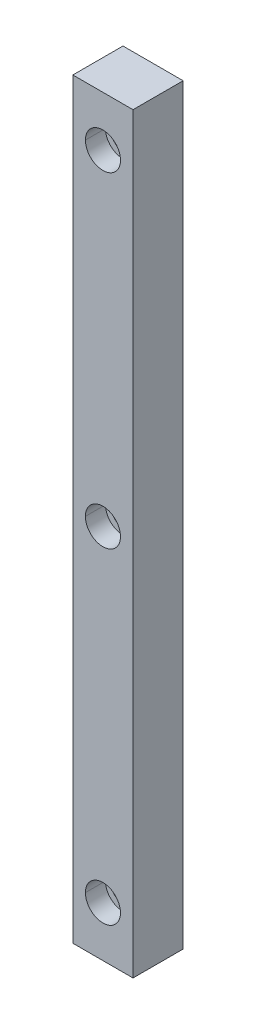
ISO-10303-21;
HEADER;
FILE_DESCRIPTION(('STEP AP214'),'2;1');
FILE_NAME('part.step','',(''),(''),'','','');
FILE_SCHEMA(('AUTOMOTIVE_DESIGN { 1 0 10303 214 1 1 1 1 }'));
ENDSEC;
DATA;
#1=APPLICATION_CONTEXT('core data for automotive mechanical design processes');
#2=APPLICATION_PROTOCOL_DEFINITION('international standard','automotive_design',2000,#1);
#3=PRODUCT_CONTEXT('',#1,'mechanical');
#4=PRODUCT('Part','Part','',(#3));
#5=PRODUCT_RELATED_PRODUCT_CATEGORY('part','',(#4));
#6=PRODUCT_DEFINITION_FORMATION('','',#4);
#7=PRODUCT_DEFINITION_CONTEXT('part definition',#1,'design');
#8=PRODUCT_DEFINITION('design','',#6,#7);
#9=PRODUCT_DEFINITION_SHAPE('','',#8);
#10=(LENGTH_UNIT() NAMED_UNIT(*) SI_UNIT(.MILLI.,.METRE.));
#11=(NAMED_UNIT(*) PLANE_ANGLE_UNIT() SI_UNIT($,.RADIAN.));
#12=(NAMED_UNIT(*) SI_UNIT($,.STERADIAN.) SOLID_ANGLE_UNIT());
#13=UNCERTAINTY_MEASURE_WITH_UNIT(LENGTH_MEASURE(1.E-05),#10,'distance_accuracy_value','');
#14=(GEOMETRIC_REPRESENTATION_CONTEXT(3) GLOBAL_UNCERTAINTY_ASSIGNED_CONTEXT((#13)) GLOBAL_UNIT_ASSIGNED_CONTEXT((#10,
#11,#12)) REPRESENTATION_CONTEXT('',''));
#15=CARTESIAN_POINT('',(0.,0.,0.));
#16=DIRECTION('',(0.,0.,1.));
#17=DIRECTION('',(1.,0.,0.));
#18=AXIS2_PLACEMENT_3D('',#15,#16,#17);
#19=CARTESIAN_POINT('',(0.,-65.,6.));
#20=DIRECTION('',(0.,0.,1.));
#21=DIRECTION('',(1.,0.,0.));
#22=AXIS2_PLACEMENT_3D('',#19,#20,#21);
#23=CYLINDRICAL_SURFACE('',#22,3.5);
#24=CARTESIAN_POINT('',(0.,-65.,6.));
#25=DIRECTION('',(0.,0.,1.));
#26=DIRECTION('',(1.,0.,0.));
#27=AXIS2_PLACEMENT_3D('',#24,#25,#26);
#28=CIRCLE('',#27,3.5);
#29=CARTESIAN_POINT('',(-3.5,-65.,6.));
#30=VERTEX_POINT('',#29);
#31=CARTESIAN_POINT('',(3.5,-65.,6.));
#32=VERTEX_POINT('',#31);
#33=EDGE_CURVE('E41',#30,#32,#28,.T.);
#34=ORIENTED_EDGE('',*,*,#33,.F.);
#35=DIRECTION('',(0.,0.,1.));
#36=VECTOR('',#35,1.);
#37=CARTESIAN_POINT('',(-3.5,-65.,6.));
#38=LINE('',#37,#36);
#39=CARTESIAN_POINT('',(-3.5,-65.,10.));
#40=VERTEX_POINT('',#39);
#41=EDGE_CURVE('E11',#30,#40,#38,.T.);
#42=ORIENTED_EDGE('',*,*,#41,.T.);
#43=CARTESIAN_POINT('',(0.,-65.,10.));
#44=DIRECTION('',(0.,0.,1.));
#45=DIRECTION('',(1.,0.,0.));
#46=AXIS2_PLACEMENT_3D('',#43,#44,#45);
#47=CIRCLE('',#46,3.5);
#48=CARTESIAN_POINT('',(3.5,-65.,10.));
#49=VERTEX_POINT('',#48);
#50=EDGE_CURVE('E27',#40,#49,#47,.T.);
#51=ORIENTED_EDGE('',*,*,#50,.T.);
#52=DIRECTION('',(0.,0.,1.));
#53=VECTOR('',#52,1.);
#54=CARTESIAN_POINT('',(3.5,-65.,6.));
#55=LINE('',#54,#53);
#56=EDGE_CURVE('E253',#32,#49,#55,.T.);
#57=ORIENTED_EDGE('',*,*,#56,.F.);
#58=EDGE_LOOP('',(#34,#42,#51,#57));
#59=FACE_BOUND('',#58,.T.);
#60=ADVANCED_FACE('F16',(#59),#23,.F.);
#61=CARTESIAN_POINT('',(0.,0.,6.));
#62=DIRECTION('',(0.,0.,1.));
#63=DIRECTION('',(1.,0.,0.));
#64=AXIS2_PLACEMENT_3D('',#61,#62,#63);
#65=CYLINDRICAL_SURFACE('',#64,3.5);
#66=CARTESIAN_POINT('',(0.,0.,6.));
#67=DIRECTION('',(0.,0.,1.));
#68=DIRECTION('',(1.,0.,0.));
#69=AXIS2_PLACEMENT_3D('',#66,#67,#68);
#70=CIRCLE('',#69,3.5);
#71=CARTESIAN_POINT('',(-3.5,0.,6.));
#72=VERTEX_POINT('',#71);
#73=CARTESIAN_POINT('',(3.5,0.,6.));
#74=VERTEX_POINT('',#73);
#75=EDGE_CURVE('E255',#72,#74,#70,.T.);
#76=ORIENTED_EDGE('',*,*,#75,.F.);
#77=DIRECTION('',(0.,0.,1.));
#78=VECTOR('',#77,1.);
#79=CARTESIAN_POINT('',(-3.5,0.,6.));
#80=LINE('',#79,#78);
#81=CARTESIAN_POINT('',(-3.5,0.,10.));
#82=VERTEX_POINT('',#81);
#83=EDGE_CURVE('E227',#72,#82,#80,.T.);
#84=ORIENTED_EDGE('',*,*,#83,.T.);
#85=CARTESIAN_POINT('',(0.,0.,10.));
#86=DIRECTION('',(0.,0.,1.));
#87=DIRECTION('',(1.,0.,0.));
#88=AXIS2_PLACEMENT_3D('',#85,#86,#87);
#89=CIRCLE('',#88,3.5);
#90=CARTESIAN_POINT('',(3.5,0.,10.));
#91=VERTEX_POINT('',#90);
#92=EDGE_CURVE('E223',#82,#91,#89,.T.);
#93=ORIENTED_EDGE('',*,*,#92,.T.);
#94=DIRECTION('',(0.,0.,1.));
#95=VECTOR('',#94,1.);
#96=CARTESIAN_POINT('',(3.5,0.,6.));
#97=LINE('',#96,#95);
#98=EDGE_CURVE('E218',#74,#91,#97,.T.);
#99=ORIENTED_EDGE('',*,*,#98,.F.);
#100=EDGE_LOOP('',(#76,#84,#93,#99));
#101=FACE_BOUND('',#100,.T.);
#102=ADVANCED_FACE('F585',(#101),#65,.F.);
#103=CARTESIAN_POINT('',(0.,65.,6.));
#104=DIRECTION('',(0.,0.,1.));
#105=DIRECTION('',(1.,0.,0.));
#106=AXIS2_PLACEMENT_3D('',#103,#104,#105);
#107=CYLINDRICAL_SURFACE('',#106,3.5);
#108=CARTESIAN_POINT('',(0.,65.,6.));
#109=DIRECTION('',(0.,0.,1.));
#110=DIRECTION('',(1.,0.,0.));
#111=AXIS2_PLACEMENT_3D('',#108,#109,#110);
#112=CIRCLE('',#111,3.5);
#113=CARTESIAN_POINT('',(-3.5,65.,6.));
#114=VERTEX_POINT('',#113);
#115=CARTESIAN_POINT('',(3.5,65.,6.));
#116=VERTEX_POINT('',#115);
#117=EDGE_CURVE('E221',#114,#116,#112,.T.);
#118=ORIENTED_EDGE('',*,*,#117,.F.);
#119=DIRECTION('',(0.,0.,1.));
#120=VECTOR('',#119,1.);
#121=CARTESIAN_POINT('',(-3.5,65.,6.));
#122=LINE('',#121,#120);
#123=CARTESIAN_POINT('',(-3.5,65.,10.));
#124=VERTEX_POINT('',#123);
#125=EDGE_CURVE('E228',#114,#124,#122,.T.);
#126=ORIENTED_EDGE('',*,*,#125,.T.);
#127=CARTESIAN_POINT('',(0.,65.,10.));
#128=DIRECTION('',(0.,0.,1.));
#129=DIRECTION('',(1.,0.,0.));
#130=AXIS2_PLACEMENT_3D('',#127,#128,#129);
#131=CIRCLE('',#130,3.5);
#132=CARTESIAN_POINT('',(3.5,65.,10.));
#133=VERTEX_POINT('',#132);
#134=EDGE_CURVE('E197',#124,#133,#131,.T.);
#135=ORIENTED_EDGE('',*,*,#134,.T.);
#136=DIRECTION('',(0.,0.,1.));
#137=VECTOR('',#136,1.);
#138=CARTESIAN_POINT('',(3.5,65.,6.));
#139=LINE('',#138,#137);
#140=EDGE_CURVE('E308',#116,#133,#139,.T.);
#141=ORIENTED_EDGE('',*,*,#140,.F.);
#142=EDGE_LOOP('',(#118,#126,#135,#141));
#143=FACE_BOUND('',#142,.T.);
#144=ADVANCED_FACE('F18',(#143),#107,.F.);
#145=CARTESIAN_POINT('',(0.,65.,10.));
#146=DIRECTION('',(0.,0.,-1.));
#147=DIRECTION('',(-1.,0.,0.));
#148=AXIS2_PLACEMENT_3D('',#145,#146,#147);
#149=CYLINDRICAL_SURFACE('',#148,2.25);
#150=CARTESIAN_POINT('',(0.,65.,6.));
#151=DIRECTION('',(0.,0.,1.));
#152=DIRECTION('',(1.,0.,0.));
#153=AXIS2_PLACEMENT_3D('',#150,#151,#152);
#154=CIRCLE('',#153,2.25);
#155=CARTESIAN_POINT('',(-2.25,65.,6.));
#156=VERTEX_POINT('',#155);
#157=CARTESIAN_POINT('',(2.25,65.,6.));
#158=VERTEX_POINT('',#157);
#159=EDGE_CURVE('E184',#156,#158,#154,.T.);
#160=ORIENTED_EDGE('',*,*,#159,.T.);
#161=DIRECTION('',(0.,0.,-1.));
#162=VECTOR('',#161,1.);
#163=CARTESIAN_POINT('',(2.25,65.,10.));
#164=LINE('',#163,#162);
#165=CARTESIAN_POINT('',(2.25,65.,0.));
#166=VERTEX_POINT('',#165);
#167=EDGE_CURVE('E198',#158,#166,#164,.T.);
#168=ORIENTED_EDGE('',*,*,#167,.T.);
#169=CARTESIAN_POINT('',(0.,65.,0.));
#170=DIRECTION('',(0.,0.,1.));
#171=DIRECTION('',(1.,0.,0.));
#172=AXIS2_PLACEMENT_3D('',#169,#170,#171);
#173=CIRCLE('',#172,2.25);
#174=CARTESIAN_POINT('',(-2.25,65.,0.));
#175=VERTEX_POINT('',#174);
#176=EDGE_CURVE('E176',#175,#166,#173,.T.);
#177=ORIENTED_EDGE('',*,*,#176,.F.);
#178=DIRECTION('',(0.,0.,-1.));
#179=VECTOR('',#178,1.);
#180=CARTESIAN_POINT('',(-2.25,65.,10.));
#181=LINE('',#180,#179);
#182=EDGE_CURVE('E181',#156,#175,#181,.T.);
#183=ORIENTED_EDGE('',*,*,#182,.F.);
#184=EDGE_LOOP('',(#160,#168,#177,#183));
#185=FACE_BOUND('',#184,.T.);
#186=ADVANCED_FACE('F183',(#185),#149,.F.);
#187=CARTESIAN_POINT('',(0.,0.,10.));
#188=DIRECTION('',(0.,0.,-1.));
#189=DIRECTION('',(-1.,0.,0.));
#190=AXIS2_PLACEMENT_3D('',#187,#188,#189);
#191=CYLINDRICAL_SURFACE('',#190,2.25);
#192=CARTESIAN_POINT('',(0.,0.,6.));
#193=DIRECTION('',(0.,0.,1.));
#194=DIRECTION('',(1.,0.,0.));
#195=AXIS2_PLACEMENT_3D('',#192,#193,#194);
#196=CIRCLE('',#195,2.25);
#197=CARTESIAN_POINT('',(-2.25,0.,6.));
#198=VERTEX_POINT('',#197);
#199=CARTESIAN_POINT('',(2.25,0.,6.));
#200=VERTEX_POINT('',#199);
#201=EDGE_CURVE('E292',#198,#200,#196,.T.);
#202=ORIENTED_EDGE('',*,*,#201,.T.);
#203=DIRECTION('',(0.,0.,-1.));
#204=VECTOR('',#203,1.);
#205=CARTESIAN_POINT('',(2.25,0.,10.));
#206=LINE('',#205,#204);
#207=CARTESIAN_POINT('',(2.25,0.,0.));
#208=VERTEX_POINT('',#207);
#209=EDGE_CURVE('E318',#200,#208,#206,.T.);
#210=ORIENTED_EDGE('',*,*,#209,.T.);
#211=CARTESIAN_POINT('',(0.,0.,0.));
#212=DIRECTION('',(0.,0.,1.));
#213=DIRECTION('',(1.,0.,0.));
#214=AXIS2_PLACEMENT_3D('',#211,#212,#213);
#215=CIRCLE('',#214,2.25);
#216=CARTESIAN_POINT('',(-2.25,0.,0.));
#217=VERTEX_POINT('',#216);
#218=EDGE_CURVE('E217',#217,#208,#215,.T.);
#219=ORIENTED_EDGE('',*,*,#218,.F.);
#220=DIRECTION('',(0.,0.,-1.));
#221=VECTOR('',#220,1.);
#222=CARTESIAN_POINT('',(-2.25,0.,10.));
#223=LINE('',#222,#221);
#224=EDGE_CURVE('E202',#198,#217,#223,.T.);
#225=ORIENTED_EDGE('',*,*,#224,.F.);
#226=EDGE_LOOP('',(#202,#210,#219,#225));
#227=FACE_BOUND('',#226,.T.);
#228=ADVANCED_FACE('F371',(#227),#191,.F.);
#229=CARTESIAN_POINT('',(0.,-65.,10.));
#230=DIRECTION('',(0.,0.,-1.));
#231=DIRECTION('',(-1.,0.,0.));
#232=AXIS2_PLACEMENT_3D('',#229,#230,#231);
#233=CYLINDRICAL_SURFACE('',#232,2.25);
#234=CARTESIAN_POINT('',(0.,-65.,6.));
#235=DIRECTION('',(0.,0.,1.));
#236=DIRECTION('',(1.,0.,0.));
#237=AXIS2_PLACEMENT_3D('',#234,#235,#236);
#238=CIRCLE('',#237,2.25);
#239=CARTESIAN_POINT('',(-2.25,-65.,6.));
#240=VERTEX_POINT('',#239);
#241=CARTESIAN_POINT('',(2.25,-65.,6.));
#242=VERTEX_POINT('',#241);
#243=EDGE_CURVE('E315',#240,#242,#238,.T.);
#244=ORIENTED_EDGE('',*,*,#243,.T.);
#245=DIRECTION('',(0.,0.,-1.));
#246=VECTOR('',#245,1.);
#247=CARTESIAN_POINT('',(2.25,-65.,10.));
#248=LINE('',#247,#246);
#249=CARTESIAN_POINT('',(2.25,-65.,0.));
#250=VERTEX_POINT('',#249);
#251=EDGE_CURVE('E251',#242,#250,#248,.T.);
#252=ORIENTED_EDGE('',*,*,#251,.T.);
#253=CARTESIAN_POINT('',(0.,-65.,0.));
#254=DIRECTION('',(0.,0.,1.));
#255=DIRECTION('',(1.,0.,0.));
#256=AXIS2_PLACEMENT_3D('',#253,#254,#255);
#257=CIRCLE('',#256,2.25);
#258=CARTESIAN_POINT('',(-2.25,-65.,0.));
#259=VERTEX_POINT('',#258);
#260=EDGE_CURVE('E339',#259,#250,#257,.T.);
#261=ORIENTED_EDGE('',*,*,#260,.F.);
#262=DIRECTION('',(0.,0.,-1.));
#263=VECTOR('',#262,1.);
#264=CARTESIAN_POINT('',(-2.25,-65.,10.));
#265=LINE('',#264,#263);
#266=EDGE_CURVE('E252',#240,#259,#265,.T.);
#267=ORIENTED_EDGE('',*,*,#266,.F.);
#268=EDGE_LOOP('',(#244,#252,#261,#267));
#269=FACE_BOUND('',#268,.T.);
#270=ADVANCED_FACE('F542',(#269),#233,.F.);
#271=CARTESIAN_POINT('',(0.,-65.,10.));
#272=DIRECTION('',(0.,0.,-1.));
#273=DIRECTION('',(-1.,0.,0.));
#274=AXIS2_PLACEMENT_3D('',#271,#272,#273);
#275=CYLINDRICAL_SURFACE('',#274,2.25);
#276=ORIENTED_EDGE('',*,*,#251,.F.);
#277=CARTESIAN_POINT('',(0.,-65.,6.));
#278=DIRECTION('',(0.,0.,1.));
#279=DIRECTION('',(1.,0.,0.));
#280=AXIS2_PLACEMENT_3D('',#277,#278,#279);
#281=CIRCLE('',#280,2.25);
#282=EDGE_CURVE('E248',#242,#240,#281,.T.);
#283=ORIENTED_EDGE('',*,*,#282,.T.);
#284=ORIENTED_EDGE('',*,*,#266,.T.);
#285=CARTESIAN_POINT('',(0.,-65.,0.));
#286=DIRECTION('',(0.,0.,1.));
#287=DIRECTION('',(1.,0.,0.));
#288=AXIS2_PLACEMENT_3D('',#285,#286,#287);
#289=CIRCLE('',#288,2.25);
#290=EDGE_CURVE('E296',#250,#259,#289,.T.);
#291=ORIENTED_EDGE('',*,*,#290,.F.);
#292=EDGE_LOOP('',(#276,#283,#284,#291));
#293=FACE_BOUND('',#292,.T.);
#294=ADVANCED_FACE('F626',(#293),#275,.F.);
#295=CARTESIAN_POINT('',(0.,0.,10.));
#296=DIRECTION('',(0.,0.,-1.));
#297=DIRECTION('',(-1.,0.,0.));
#298=AXIS2_PLACEMENT_3D('',#295,#296,#297);
#299=CYLINDRICAL_SURFACE('',#298,2.25);
#300=ORIENTED_EDGE('',*,*,#209,.F.);
#301=CARTESIAN_POINT('',(0.,0.,6.));
#302=DIRECTION('',(0.,0.,1.));
#303=DIRECTION('',(1.,0.,0.));
#304=AXIS2_PLACEMENT_3D('',#301,#302,#303);
#305=CIRCLE('',#304,2.25);
#306=EDGE_CURVE('E20',#200,#198,#305,.T.);
#307=ORIENTED_EDGE('',*,*,#306,.T.);
#308=ORIENTED_EDGE('',*,*,#224,.T.);
#309=CARTESIAN_POINT('',(0.,0.,0.));
#310=DIRECTION('',(0.,0.,1.));
#311=DIRECTION('',(1.,0.,0.));
#312=AXIS2_PLACEMENT_3D('',#309,#310,#311);
#313=CIRCLE('',#312,2.25);
#314=EDGE_CURVE('E231',#208,#217,#313,.T.);
#315=ORIENTED_EDGE('',*,*,#314,.F.);
#316=EDGE_LOOP('',(#300,#307,#308,#315));
#317=FACE_BOUND('',#316,.T.);
#318=ADVANCED_FACE('F598',(#317),#299,.F.);
#319=CARTESIAN_POINT('',(0.,65.,10.));
#320=DIRECTION('',(0.,0.,-1.));
#321=DIRECTION('',(-1.,0.,0.));
#322=AXIS2_PLACEMENT_3D('',#319,#320,#321);
#323=CYLINDRICAL_SURFACE('',#322,2.25);
#324=ORIENTED_EDGE('',*,*,#167,.F.);
#325=CARTESIAN_POINT('',(0.,65.,6.));
#326=DIRECTION('',(0.,0.,1.));
#327=DIRECTION('',(1.,0.,0.));
#328=AXIS2_PLACEMENT_3D('',#325,#326,#327);
#329=CIRCLE('',#328,2.25);
#330=EDGE_CURVE('E191',#158,#156,#329,.T.);
#331=ORIENTED_EDGE('',*,*,#330,.T.);
#332=ORIENTED_EDGE('',*,*,#182,.T.);
#333=CARTESIAN_POINT('',(0.,65.,0.));
#334=DIRECTION('',(0.,0.,1.));
#335=DIRECTION('',(1.,0.,0.));
#336=AXIS2_PLACEMENT_3D('',#333,#334,#335);
#337=CIRCLE('',#336,2.25);
#338=EDGE_CURVE('E344',#166,#175,#337,.T.);
#339=ORIENTED_EDGE('',*,*,#338,.F.);
#340=EDGE_LOOP('',(#324,#331,#332,#339));
#341=FACE_BOUND('',#340,.T.);
#342=ADVANCED_FACE('F200',(#341),#323,.F.);
#343=CARTESIAN_POINT('',(-6.,75.,10.));
#344=DIRECTION('',(0.,0.,1.));
#345=DIRECTION('',(1.,0.,0.));
#346=AXIS2_PLACEMENT_3D('',#343,#344,#345);
#347=PLANE('',#346);
#348=DIRECTION('',(0.,-1.,0.));
#349=VECTOR('',#348,1.);
#350=CARTESIAN_POINT('',(-6.,-75.,10.));
#351=LINE('',#350,#349);
#352=CARTESIAN_POINT('',(-6.,75.,10.));
#353=VERTEX_POINT('',#352);
#354=CARTESIAN_POINT('',(-6.,-75.,10.));
#355=VERTEX_POINT('',#354);
#356=EDGE_CURVE('E192',#353,#355,#351,.T.);
#357=ORIENTED_EDGE('',*,*,#356,.T.);
#358=DIRECTION('',(1.,0.,0.));
#359=VECTOR('',#358,1.);
#360=CARTESIAN_POINT('',(6.,-75.,10.));
#361=LINE('',#360,#359);
#362=CARTESIAN_POINT('',(6.,-75.,10.));
#363=VERTEX_POINT('',#362);
#364=EDGE_CURVE('E212',#355,#363,#361,.T.);
#365=ORIENTED_EDGE('',*,*,#364,.T.);
#366=DIRECTION('',(0.,1.,0.));
#367=VECTOR('',#366,1.);
#368=CARTESIAN_POINT('',(6.,-75.,10.));
#369=LINE('',#368,#367);
#370=CARTESIAN_POINT('',(6.,75.,10.));
#371=VERTEX_POINT('',#370);
#372=EDGE_CURVE('E216',#363,#371,#369,.T.);
#373=ORIENTED_EDGE('',*,*,#372,.T.);
#374=DIRECTION('',(-1.,0.,0.));
#375=VECTOR('',#374,1.);
#376=CARTESIAN_POINT('',(6.,75.,10.));
#377=LINE('',#376,#375);
#378=EDGE_CURVE('E128',#371,#353,#377,.T.);
#379=ORIENTED_EDGE('',*,*,#378,.T.);
#380=EDGE_LOOP('',(#357,#365,#373,#379));
#381=FACE_BOUND('',#380,.T.);
#382=CARTESIAN_POINT('',(0.,-65.,10.));
#383=DIRECTION('',(0.,0.,1.));
#384=DIRECTION('',(1.,0.,0.));
#385=AXIS2_PLACEMENT_3D('',#382,#383,#384);
#386=CIRCLE('',#385,3.5);
#387=EDGE_CURVE('E256',#49,#40,#386,.T.);
#388=ORIENTED_EDGE('',*,*,#387,.F.);
#389=ORIENTED_EDGE('',*,*,#50,.F.);
#390=EDGE_LOOP('',(#388,#389));
#391=FACE_BOUND('',#390,.T.);
#392=CARTESIAN_POINT('',(0.,0.,10.));
#393=DIRECTION('',(0.,0.,1.));
#394=DIRECTION('',(1.,0.,0.));
#395=AXIS2_PLACEMENT_3D('',#392,#393,#394);
#396=CIRCLE('',#395,3.5);
#397=EDGE_CURVE('E222',#91,#82,#396,.T.);
#398=ORIENTED_EDGE('',*,*,#397,.F.);
#399=ORIENTED_EDGE('',*,*,#92,.F.);
#400=EDGE_LOOP('',(#398,#399));
#401=FACE_BOUND('',#400,.T.);
#402=CARTESIAN_POINT('',(0.,65.,10.));
#403=DIRECTION('',(0.,0.,1.));
#404=DIRECTION('',(1.,0.,0.));
#405=AXIS2_PLACEMENT_3D('',#402,#403,#404);
#406=CIRCLE('',#405,3.5);
#407=EDGE_CURVE('E283',#133,#124,#406,.T.);
#408=ORIENTED_EDGE('',*,*,#407,.F.);
#409=ORIENTED_EDGE('',*,*,#134,.F.);
#410=EDGE_LOOP('',(#408,#409));
#411=FACE_BOUND('',#410,.T.);
#412=ADVANCED_FACE('F597',(#381,#391,#401,#411),#347,.T.);
#413=CARTESIAN_POINT('',(-6.,75.,0.));
#414=DIRECTION('',(0.,0.,1.));
#415=DIRECTION('',(1.,0.,0.));
#416=AXIS2_PLACEMENT_3D('',#413,#414,#415);
#417=PLANE('',#416);
#418=DIRECTION('',(0.,-1.,0.));
#419=VECTOR('',#418,1.);
#420=CARTESIAN_POINT('',(-6.,-75.,0.));
#421=LINE('',#420,#419);
#422=CARTESIAN_POINT('',(-6.,75.,0.));
#423=VERTEX_POINT('',#422);
#424=CARTESIAN_POINT('',(-6.,-75.,0.));
#425=VERTEX_POINT('',#424);
#426=EDGE_CURVE('E236',#423,#425,#421,.T.);
#427=ORIENTED_EDGE('',*,*,#426,.F.);
#428=DIRECTION('',(-1.,0.,0.));
#429=VECTOR('',#428,1.);
#430=CARTESIAN_POINT('',(6.,75.,0.));
#431=LINE('',#430,#429);
#432=CARTESIAN_POINT('',(6.,75.,0.));
#433=VERTEX_POINT('',#432);
#434=EDGE_CURVE('E299',#433,#423,#431,.T.);
#435=ORIENTED_EDGE('',*,*,#434,.F.);
#436=DIRECTION('',(0.,1.,0.));
#437=VECTOR('',#436,1.);
#438=CARTESIAN_POINT('',(6.,-75.,0.));
#439=LINE('',#438,#437);
#440=CARTESIAN_POINT('',(6.,-75.,0.));
#441=VERTEX_POINT('',#440);
#442=EDGE_CURVE('E238',#441,#433,#439,.T.);
#443=ORIENTED_EDGE('',*,*,#442,.F.);
#444=DIRECTION('',(1.,0.,0.));
#445=VECTOR('',#444,1.);
#446=CARTESIAN_POINT('',(6.,-75.,0.));
#447=LINE('',#446,#445);
#448=EDGE_CURVE('E237',#425,#441,#447,.T.);
#449=ORIENTED_EDGE('',*,*,#448,.F.);
#450=EDGE_LOOP('',(#427,#435,#443,#449));
#451=FACE_BOUND('',#450,.T.);
#452=ORIENTED_EDGE('',*,*,#218,.T.);
#453=ORIENTED_EDGE('',*,*,#314,.T.);
#454=EDGE_LOOP('',(#452,#453));
#455=FACE_BOUND('',#454,.T.);
#456=ORIENTED_EDGE('',*,*,#176,.T.);
#457=ORIENTED_EDGE('',*,*,#338,.T.);
#458=EDGE_LOOP('',(#456,#457));
#459=FACE_BOUND('',#458,.T.);
#460=ORIENTED_EDGE('',*,*,#260,.T.);
#461=ORIENTED_EDGE('',*,*,#290,.T.);
#462=EDGE_LOOP('',(#460,#461));
#463=FACE_BOUND('',#462,.T.);
#464=ADVANCED_FACE('F606',(#451,#455,#459,#463),#417,.F.);
#465=CARTESIAN_POINT('',(-6.,-75.,10.));
#466=DIRECTION('',(1.,0.,0.));
#467=DIRECTION('',(0.,1.,0.));
#468=AXIS2_PLACEMENT_3D('',#465,#466,#467);
#469=PLANE('',#468);
#470=ORIENTED_EDGE('',*,*,#426,.T.);
#471=DIRECTION('',(0.,0.,-1.));
#472=VECTOR('',#471,1.);
#473=CARTESIAN_POINT('',(-6.,-75.,10.));
#474=LINE('',#473,#472);
#475=EDGE_CURVE('E242',#355,#425,#474,.T.);
#476=ORIENTED_EDGE('',*,*,#475,.F.);
#477=ORIENTED_EDGE('',*,*,#356,.F.);
#478=DIRECTION('',(0.,0.,-1.));
#479=VECTOR('',#478,1.);
#480=CARTESIAN_POINT('',(-6.,75.,10.));
#481=LINE('',#480,#479);
#482=EDGE_CURVE('E232',#353,#423,#481,.T.);
#483=ORIENTED_EDGE('',*,*,#482,.T.);
#484=EDGE_LOOP('',(#470,#476,#477,#483));
#485=FACE_BOUND('',#484,.T.);
#486=ADVANCED_FACE('F552',(#485),#469,.F.);
#487=CARTESIAN_POINT('',(6.,-75.,10.));
#488=DIRECTION('',(0.,1.,0.));
#489=DIRECTION('',(1.,0.,0.));
#490=AXIS2_PLACEMENT_3D('',#487,#488,#489);
#491=PLANE('',#490);
#492=ORIENTED_EDGE('',*,*,#448,.T.);
#493=DIRECTION('',(0.,0.,-1.));
#494=VECTOR('',#493,1.);
#495=CARTESIAN_POINT('',(6.,-75.,10.));
#496=LINE('',#495,#494);
#497=EDGE_CURVE('E243',#363,#441,#496,.T.);
#498=ORIENTED_EDGE('',*,*,#497,.F.);
#499=ORIENTED_EDGE('',*,*,#364,.F.);
#500=ORIENTED_EDGE('',*,*,#475,.T.);
#501=EDGE_LOOP('',(#492,#498,#499,#500));
#502=FACE_BOUND('',#501,.T.);
#503=ADVANCED_FACE('F547',(#502),#491,.F.);
#504=CARTESIAN_POINT('',(6.,-75.,10.));
#505=DIRECTION('',(-1.,0.,0.));
#506=DIRECTION('',(0.,0.,1.));
#507=AXIS2_PLACEMENT_3D('',#504,#505,#506);
#508=PLANE('',#507);
#509=ORIENTED_EDGE('',*,*,#442,.T.);
#510=DIRECTION('',(0.,0.,-1.));
#511=VECTOR('',#510,1.);
#512=CARTESIAN_POINT('',(6.,75.,10.));
#513=LINE('',#512,#511);
#514=EDGE_CURVE('E302',#371,#433,#513,.T.);
#515=ORIENTED_EDGE('',*,*,#514,.F.);
#516=ORIENTED_EDGE('',*,*,#372,.F.);
#517=ORIENTED_EDGE('',*,*,#497,.T.);
#518=EDGE_LOOP('',(#509,#515,#516,#517));
#519=FACE_BOUND('',#518,.T.);
#520=ADVANCED_FACE('F551',(#519),#508,.F.);
#521=CARTESIAN_POINT('',(6.,75.,10.));
#522=DIRECTION('',(0.,-1.,0.));
#523=DIRECTION('',(0.,0.,-1.));
#524=AXIS2_PLACEMENT_3D('',#521,#522,#523);
#525=PLANE('',#524);
#526=ORIENTED_EDGE('',*,*,#434,.T.);
#527=ORIENTED_EDGE('',*,*,#482,.F.);
#528=ORIENTED_EDGE('',*,*,#378,.F.);
#529=ORIENTED_EDGE('',*,*,#514,.T.);
#530=EDGE_LOOP('',(#526,#527,#528,#529));
#531=FACE_BOUND('',#530,.T.);
#532=ADVANCED_FACE('F638',(#531),#525,.F.);
#533=CARTESIAN_POINT('',(0.,65.,6.));
#534=DIRECTION('',(0.,0.,1.));
#535=DIRECTION('',(1.,0.,0.));
#536=AXIS2_PLACEMENT_3D('',#533,#534,#535);
#537=CYLINDRICAL_SURFACE('',#536,3.5);
#538=ORIENTED_EDGE('',*,*,#125,.F.);
#539=CARTESIAN_POINT('',(0.,65.,6.));
#540=DIRECTION('',(0.,0.,1.));
#541=DIRECTION('',(1.,0.,0.));
#542=AXIS2_PLACEMENT_3D('',#539,#540,#541);
#543=CIRCLE('',#542,3.5);
#544=EDGE_CURVE('E247',#116,#114,#543,.T.);
#545=ORIENTED_EDGE('',*,*,#544,.F.);
#546=ORIENTED_EDGE('',*,*,#140,.T.);
#547=ORIENTED_EDGE('',*,*,#407,.T.);
#548=EDGE_LOOP('',(#538,#545,#546,#547));
#549=FACE_BOUND('',#548,.T.);
#550=ADVANCED_FACE('F571',(#549),#537,.F.);
#551=CARTESIAN_POINT('',(0.,65.,6.));
#552=DIRECTION('',(0.,0.,1.));
#553=DIRECTION('',(1.,0.,0.));
#554=AXIS2_PLACEMENT_3D('',#551,#552,#553);
#555=PLANE('',#554);
#556=ORIENTED_EDGE('',*,*,#544,.T.);
#557=ORIENTED_EDGE('',*,*,#117,.T.);
#558=EDGE_LOOP('',(#556,#557));
#559=FACE_BOUND('',#558,.T.);
#560=ORIENTED_EDGE('',*,*,#159,.F.);
#561=ORIENTED_EDGE('',*,*,#330,.F.);
#562=EDGE_LOOP('',(#560,#561));
#563=FACE_BOUND('',#562,.T.);
#564=ADVANCED_FACE('F195',(#559,#563),#555,.T.);
#565=CARTESIAN_POINT('',(0.,0.,6.));
#566=DIRECTION('',(0.,0.,1.));
#567=DIRECTION('',(1.,0.,0.));
#568=AXIS2_PLACEMENT_3D('',#565,#566,#567);
#569=CYLINDRICAL_SURFACE('',#568,3.5);
#570=ORIENTED_EDGE('',*,*,#83,.F.);
#571=CARTESIAN_POINT('',(0.,0.,6.));
#572=DIRECTION('',(0.,0.,1.));
#573=DIRECTION('',(1.,0.,0.));
#574=AXIS2_PLACEMENT_3D('',#571,#572,#573);
#575=CIRCLE('',#574,3.5);
#576=EDGE_CURVE('E265',#74,#72,#575,.T.);
#577=ORIENTED_EDGE('',*,*,#576,.F.);
#578=ORIENTED_EDGE('',*,*,#98,.T.);
#579=ORIENTED_EDGE('',*,*,#397,.T.);
#580=EDGE_LOOP('',(#570,#577,#578,#579));
#581=FACE_BOUND('',#580,.T.);
#582=ADVANCED_FACE('F570',(#581),#569,.F.);
#583=CARTESIAN_POINT('',(0.,0.,6.));
#584=DIRECTION('',(0.,0.,1.));
#585=DIRECTION('',(1.,0.,0.));
#586=AXIS2_PLACEMENT_3D('',#583,#584,#585);
#587=PLANE('',#586);
#588=ORIENTED_EDGE('',*,*,#576,.T.);
#589=ORIENTED_EDGE('',*,*,#75,.T.);
#590=EDGE_LOOP('',(#588,#589));
#591=FACE_BOUND('',#590,.T.);
#592=ORIENTED_EDGE('',*,*,#201,.F.);
#593=ORIENTED_EDGE('',*,*,#306,.F.);
#594=EDGE_LOOP('',(#592,#593));
#595=FACE_BOUND('',#594,.T.);
#596=ADVANCED_FACE('F375',(#591,#595),#587,.T.);
#597=CARTESIAN_POINT('',(0.,-65.,6.));
#598=DIRECTION('',(0.,0.,1.));
#599=DIRECTION('',(1.,0.,0.));
#600=AXIS2_PLACEMENT_3D('',#597,#598,#599);
#601=CYLINDRICAL_SURFACE('',#600,3.5);
#602=ORIENTED_EDGE('',*,*,#41,.F.);
#603=CARTESIAN_POINT('',(0.,-65.,6.));
#604=DIRECTION('',(0.,0.,1.));
#605=DIRECTION('',(1.,0.,0.));
#606=AXIS2_PLACEMENT_3D('',#603,#604,#605);
#607=CIRCLE('',#606,3.5);
#608=EDGE_CURVE('E267',#32,#30,#607,.T.);
#609=ORIENTED_EDGE('',*,*,#608,.F.);
#610=ORIENTED_EDGE('',*,*,#56,.T.);
#611=ORIENTED_EDGE('',*,*,#387,.T.);
#612=EDGE_LOOP('',(#602,#609,#610,#611));
#613=FACE_BOUND('',#612,.T.);
#614=ADVANCED_FACE('F562',(#613),#601,.F.);
#615=CARTESIAN_POINT('',(0.,-65.,6.));
#616=DIRECTION('',(0.,0.,1.));
#617=DIRECTION('',(1.,0.,0.));
#618=AXIS2_PLACEMENT_3D('',#615,#616,#617);
#619=PLANE('',#618);
#620=ORIENTED_EDGE('',*,*,#608,.T.);
#621=ORIENTED_EDGE('',*,*,#33,.T.);
#622=EDGE_LOOP('',(#620,#621));
#623=FACE_BOUND('',#622,.T.);
#624=ORIENTED_EDGE('',*,*,#243,.F.);
#625=ORIENTED_EDGE('',*,*,#282,.F.);
#626=EDGE_LOOP('',(#624,#625));
#627=FACE_BOUND('',#626,.T.);
#628=ADVANCED_FACE('F558',(#623,#627),#619,.T.);
#629=CLOSED_SHELL('',(#60,#102,#144,#186,#228,#270,#294,#318,#342,#412,#464,#486,#503,#520,#532,
#550,#564,#582,#596,#614,#628));
#630=MANIFOLD_SOLID_BREP('B1',#629);
#631=ADVANCED_BREP_SHAPE_REPRESENTATION('',(#18,#630),#14);
#632=SHAPE_DEFINITION_REPRESENTATION(#9,#631);
ENDSEC;
END-ISO-10303-21;
